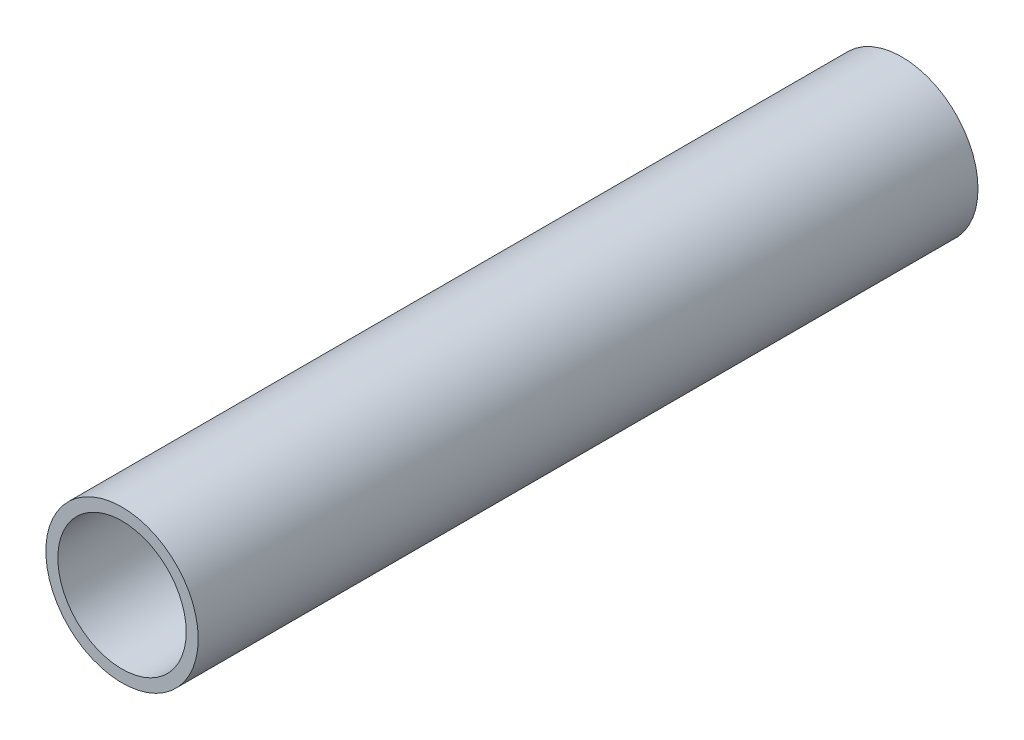
ISO-10303-21;
HEADER;
FILE_DESCRIPTION(('STEP AP214'),'2;1');
FILE_NAME('part.step','',(''),(''),'','','');
FILE_SCHEMA(('AUTOMOTIVE_DESIGN { 1 0 10303 214 1 1 1 1 }'));
ENDSEC;
DATA;
#1=APPLICATION_CONTEXT('core data for automotive mechanical design processes');
#2=APPLICATION_PROTOCOL_DEFINITION('international standard','automotive_design',2000,#1);
#3=PRODUCT_CONTEXT('',#1,'mechanical');
#4=PRODUCT('Part','Part','',(#3));
#5=PRODUCT_RELATED_PRODUCT_CATEGORY('part','',(#4));
#6=PRODUCT_DEFINITION_FORMATION('','',#4);
#7=PRODUCT_DEFINITION_CONTEXT('part definition',#1,'design');
#8=PRODUCT_DEFINITION('design','',#6,#7);
#9=PRODUCT_DEFINITION_SHAPE('','',#8);
#10=(LENGTH_UNIT() NAMED_UNIT(*) SI_UNIT(.MILLI.,.METRE.));
#11=(NAMED_UNIT(*) PLANE_ANGLE_UNIT() SI_UNIT($,.RADIAN.));
#12=(NAMED_UNIT(*) SI_UNIT($,.STERADIAN.) SOLID_ANGLE_UNIT());
#13=UNCERTAINTY_MEASURE_WITH_UNIT(LENGTH_MEASURE(1.E-05),#10,'distance_accuracy_value','');
#14=(GEOMETRIC_REPRESENTATION_CONTEXT(3) GLOBAL_UNCERTAINTY_ASSIGNED_CONTEXT((#13)) GLOBAL_UNIT_ASSIGNED_CONTEXT((#10,
#11,#12)) REPRESENTATION_CONTEXT('',''));
#15=CARTESIAN_POINT('',(0.,0.,0.));
#16=DIRECTION('',(0.,0.,1.));
#17=DIRECTION('',(1.,0.,0.));
#18=AXIS2_PLACEMENT_3D('',#15,#16,#17);
#19=CARTESIAN_POINT('',(0.,0.,130.));
#20=DIRECTION('',(0.,0.,1.));
#21=DIRECTION('',(1.,0.,0.));
#22=AXIS2_PLACEMENT_3D('',#19,#20,#21);
#23=PLANE('',#22);
#24=CARTESIAN_POINT('',(0.,0.,130.));
#25=DIRECTION('',(0.,0.,1.));
#26=DIRECTION('',(1.,0.,0.));
#27=AXIS2_PLACEMENT_3D('',#24,#25,#26);
#28=CIRCLE('',#27,12.7);
#29=CARTESIAN_POINT('',(12.7,0.,130.));
#30=VERTEX_POINT('',#29);
#31=EDGE_CURVE('E10',#30,#30,#28,.T.);
#32=ORIENTED_EDGE('',*,*,#31,.T.);
#33=EDGE_LOOP('',(#32));
#34=FACE_BOUND('',#33,.T.);
#35=CARTESIAN_POINT('',(0.,0.,130.));
#36=DIRECTION('',(0.,0.,1.));
#37=DIRECTION('',(1.,0.,0.));
#38=AXIS2_PLACEMENT_3D('',#35,#36,#37);
#39=CIRCLE('',#38,10.7);
#40=CARTESIAN_POINT('',(10.7,0.,130.));
#41=VERTEX_POINT('',#40);
#42=EDGE_CURVE('E43',#41,#41,#39,.T.);
#43=ORIENTED_EDGE('',*,*,#42,.F.);
#44=EDGE_LOOP('',(#43));
#45=FACE_BOUND('',#44,.T.);
#46=ADVANCED_FACE('F32',(#34,#45),#23,.T.);
#47=CARTESIAN_POINT('',(0.,0.,0.));
#48=DIRECTION('',(0.,0.,1.));
#49=DIRECTION('',(1.,0.,0.));
#50=AXIS2_PLACEMENT_3D('',#47,#48,#49);
#51=PLANE('',#50);
#52=CARTESIAN_POINT('',(0.,0.,0.));
#53=DIRECTION('',(0.,0.,1.));
#54=DIRECTION('',(1.,0.,0.));
#55=AXIS2_PLACEMENT_3D('',#52,#53,#54);
#56=CIRCLE('',#55,12.7);
#57=CARTESIAN_POINT('',(12.7,0.,0.));
#58=VERTEX_POINT('',#57);
#59=EDGE_CURVE('E36',#58,#58,#56,.T.);
#60=ORIENTED_EDGE('',*,*,#59,.F.);
#61=EDGE_LOOP('',(#60));
#62=FACE_BOUND('',#61,.T.);
#63=CARTESIAN_POINT('',(0.,0.,0.));
#64=DIRECTION('',(0.,0.,1.));
#65=DIRECTION('',(1.,0.,0.));
#66=AXIS2_PLACEMENT_3D('',#63,#64,#65);
#67=CIRCLE('',#66,10.7);
#68=CARTESIAN_POINT('',(10.7,0.,0.));
#69=VERTEX_POINT('',#68);
#70=EDGE_CURVE('E45',#69,#69,#67,.T.);
#71=ORIENTED_EDGE('',*,*,#70,.T.);
#72=EDGE_LOOP('',(#71));
#73=FACE_BOUND('',#72,.T.);
#74=ADVANCED_FACE('F55',(#62,#73),#51,.F.);
#75=CARTESIAN_POINT('',(0.,0.,130.));
#76=DIRECTION('',(0.,0.,-1.));
#77=DIRECTION('',(-1.,0.,0.));
#78=AXIS2_PLACEMENT_3D('',#75,#76,#77);
#79=CYLINDRICAL_SURFACE('',#78,12.7);
#80=ORIENTED_EDGE('',*,*,#31,.F.);
#81=EDGE_LOOP('',(#80));
#82=FACE_BOUND('',#81,.T.);
#83=ORIENTED_EDGE('',*,*,#59,.T.);
#84=EDGE_LOOP('',(#83));
#85=FACE_BOUND('',#84,.T.);
#86=ADVANCED_FACE('F34',(#82,#85),#79,.T.);
#87=CARTESIAN_POINT('',(0.,0.,130.));
#88=DIRECTION('',(0.,0.,-1.));
#89=DIRECTION('',(-1.,0.,0.));
#90=AXIS2_PLACEMENT_3D('',#87,#88,#89);
#91=CYLINDRICAL_SURFACE('',#90,10.7);
#92=ORIENTED_EDGE('',*,*,#42,.T.);
#93=EDGE_LOOP('',(#92));
#94=FACE_BOUND('',#93,.T.);
#95=ORIENTED_EDGE('',*,*,#70,.F.);
#96=EDGE_LOOP('',(#95));
#97=FACE_BOUND('',#96,.T.);
#98=ADVANCED_FACE('F51',(#94,#97),#91,.F.);
#99=CLOSED_SHELL('',(#46,#74,#86,#98));
#100=MANIFOLD_SOLID_BREP('B2',#99);
#101=ADVANCED_BREP_SHAPE_REPRESENTATION('',(#18,#100),#14);
#102=SHAPE_DEFINITION_REPRESENTATION(#9,#101);
ENDSEC;
END-ISO-10303-21;
